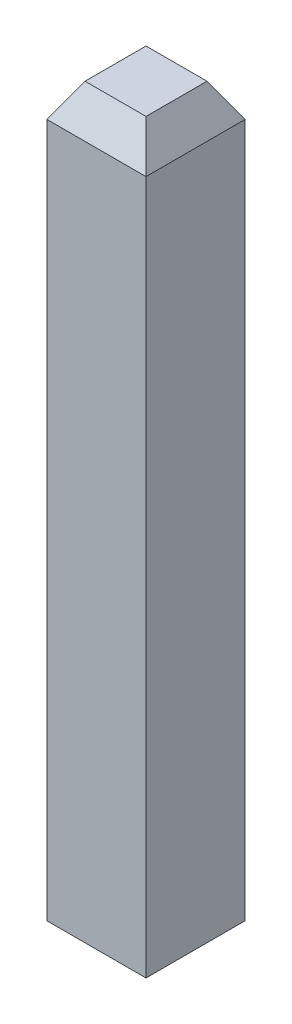
ISO-10303-21;
HEADER;
FILE_DESCRIPTION(('STEP AP214'),'2;1');
FILE_NAME('part.step','',(''),(''),'','','');
FILE_SCHEMA(('AUTOMOTIVE_DESIGN { 1 0 10303 214 1 1 1 1 }'));
ENDSEC;
DATA;
#1=APPLICATION_CONTEXT('core data for automotive mechanical design processes');
#2=APPLICATION_PROTOCOL_DEFINITION('international standard','automotive_design',2000,#1);
#3=PRODUCT_CONTEXT('',#1,'mechanical');
#4=PRODUCT('Part','Part','',(#3));
#5=PRODUCT_RELATED_PRODUCT_CATEGORY('part','',(#4));
#6=PRODUCT_DEFINITION_FORMATION('','',#4);
#7=PRODUCT_DEFINITION_CONTEXT('part definition',#1,'design');
#8=PRODUCT_DEFINITION('design','',#6,#7);
#9=PRODUCT_DEFINITION_SHAPE('','',#8);
#10=(LENGTH_UNIT() NAMED_UNIT(*) SI_UNIT(.MILLI.,.METRE.));
#11=(NAMED_UNIT(*) PLANE_ANGLE_UNIT() SI_UNIT($,.RADIAN.));
#12=(NAMED_UNIT(*) SI_UNIT($,.STERADIAN.) SOLID_ANGLE_UNIT());
#13=UNCERTAINTY_MEASURE_WITH_UNIT(LENGTH_MEASURE(1.E-05),#10,'distance_accuracy_value','');
#14=(GEOMETRIC_REPRESENTATION_CONTEXT(3) GLOBAL_UNCERTAINTY_ASSIGNED_CONTEXT((#13)) GLOBAL_UNIT_ASSIGNED_CONTEXT((#10,
#11,#12)) REPRESENTATION_CONTEXT('',''));
#15=CARTESIAN_POINT('',(0.,0.,0.));
#16=DIRECTION('',(0.,0.,1.));
#17=DIRECTION('',(1.,0.,0.));
#18=AXIS2_PLACEMENT_3D('',#15,#16,#17);
#19=CARTESIAN_POINT('',(-0.184529946162075,6.1,0.));
#20=DIRECTION('',(-0.86602540378444,0.499999999999998,0.));
#21=DIRECTION('',(-0.499999999999998,-0.86602540378444,0.));
#22=AXIS2_PLACEMENT_3D('',#19,#20,#21);
#23=PLANE('',#22);
#24=DIRECTION('',(-0.447213595499959,-0.774596669241484,0.447213595499956));
#25=VECTOR('',#24,1.);
#26=CARTESIAN_POINT('',(-0.184529946162075,6.1,0.734529946162076));
#27=LINE('',#26,#25);
#28=CARTESIAN_POINT('',(-0.184529946162075,6.1,0.734529946162076));
#29=VERTEX_POINT('',#28);
#30=CARTESIAN_POINT('',(-0.3,5.9,0.850000000000001));
#31=VERTEX_POINT('',#30);
#32=EDGE_CURVE('E80',#29,#31,#27,.T.);
#33=ORIENTED_EDGE('',*,*,#32,.F.);
#34=DIRECTION('',(0.,0.,1.));
#35=VECTOR('',#34,1.);
#36=CARTESIAN_POINT('',(-0.184529946162075,6.1,0.));
#37=LINE('',#36,#35);
#38=CARTESIAN_POINT('',(-0.184529946162075,6.1,0.365470053837926));
#39=VERTEX_POINT('',#38);
#40=EDGE_CURVE('E20',#39,#29,#37,.T.);
#41=ORIENTED_EDGE('',*,*,#40,.F.);
#42=DIRECTION('',(0.447213595499959,0.774596669241484,0.447213595499956));
#43=VECTOR('',#42,1.);
#44=CARTESIAN_POINT('',(-0.3,5.9,0.250000000000002));
#45=LINE('',#44,#43);
#46=CARTESIAN_POINT('',(-0.3,5.9,0.250000000000001));
#47=VERTEX_POINT('',#46);
#48=EDGE_CURVE('E66',#47,#39,#45,.T.);
#49=ORIENTED_EDGE('',*,*,#48,.F.);
#50=DIRECTION('',(0.,0.,-1.));
#51=VECTOR('',#50,1.);
#52=CARTESIAN_POINT('',(-0.3,5.9,0.250000000000001));
#53=LINE('',#52,#51);
#54=EDGE_CURVE('E87',#47,#31,#53,.F.);
#55=ORIENTED_EDGE('',*,*,#54,.T.);
#56=EDGE_LOOP('',(#33,#41,#49,#55));
#57=FACE_BOUND('',#56,.T.);
#58=ADVANCED_FACE('F17',(#57),#23,.T.);
#59=CARTESIAN_POINT('',(0.,6.1,0.));
#60=DIRECTION('',(0.,1.,0.));
#61=DIRECTION('',(0.,0.,1.));
#62=AXIS2_PLACEMENT_3D('',#59,#60,#61);
#63=PLANE('',#62);
#64=DIRECTION('',(0.,0.,1.));
#65=VECTOR('',#64,1.);
#66=CARTESIAN_POINT('',(0.184529946162075,6.1,0.));
#67=LINE('',#66,#65);
#68=CARTESIAN_POINT('',(0.184529946162075,6.1,0.365470053837926));
#69=VERTEX_POINT('',#68);
#70=CARTESIAN_POINT('',(0.184529946162075,6.1,0.734529946162076));
#71=VERTEX_POINT('',#70);
#72=EDGE_CURVE('E106',#69,#71,#67,.T.);
#73=ORIENTED_EDGE('',*,*,#72,.F.);
#74=DIRECTION('',(1.,0.,0.));
#75=VECTOR('',#74,1.);
#76=CARTESIAN_POINT('',(0.,6.1,0.365470053837926));
#77=LINE('',#76,#75);
#78=EDGE_CURVE('E77',#39,#69,#77,.T.);
#79=ORIENTED_EDGE('',*,*,#78,.F.);
#80=ORIENTED_EDGE('',*,*,#40,.T.);
#81=DIRECTION('',(1.,0.,0.));
#82=VECTOR('',#81,1.);
#83=CARTESIAN_POINT('',(0.,6.1,0.734529946162076));
#84=LINE('',#83,#82);
#85=EDGE_CURVE('E75',#71,#29,#84,.F.);
#86=ORIENTED_EDGE('',*,*,#85,.F.);
#87=EDGE_LOOP('',(#73,#79,#80,#86));
#88=FACE_BOUND('',#87,.T.);
#89=ADVANCED_FACE('F74',(#88),#63,.T.);
#90=CARTESIAN_POINT('',(0.,6.1,0.734529946162076));
#91=DIRECTION('',(0.,0.499999999999998,0.86602540378444));
#92=DIRECTION('',(0.,-0.86602540378444,0.499999999999998));
#93=AXIS2_PLACEMENT_3D('',#90,#91,#92);
#94=PLANE('',#93);
#95=DIRECTION('',(0.447213595499956,-0.774596669241484,0.447213595499959));
#96=VECTOR('',#95,1.);
#97=CARTESIAN_POINT('',(0.184529946162075,6.1,0.734529946162076));
#98=LINE('',#97,#96);
#99=CARTESIAN_POINT('',(0.3,5.9,0.850000000000001));
#100=VERTEX_POINT('',#99);
#101=EDGE_CURVE('E85',#71,#100,#98,.T.);
#102=ORIENTED_EDGE('',*,*,#101,.F.);
#103=ORIENTED_EDGE('',*,*,#85,.T.);
#104=ORIENTED_EDGE('',*,*,#32,.T.);
#105=DIRECTION('',(-1.,0.,0.));
#106=VECTOR('',#105,1.);
#107=CARTESIAN_POINT('',(-0.3,5.9,0.850000000000001));
#108=LINE('',#107,#106);
#109=EDGE_CURVE('E101',#31,#100,#108,.F.);
#110=ORIENTED_EDGE('',*,*,#109,.T.);
#111=EDGE_LOOP('',(#102,#103,#104,#110));
#112=FACE_BOUND('',#111,.T.);
#113=ADVANCED_FACE('F82',(#112),#94,.T.);
#114=CARTESIAN_POINT('',(0.,6.1,0.365470053837926));
#115=DIRECTION('',(0.,0.499999999999998,-0.86602540378444));
#116=DIRECTION('',(0.,0.86602540378444,0.499999999999998));
#117=AXIS2_PLACEMENT_3D('',#114,#115,#116);
#118=PLANE('',#117);
#119=ORIENTED_EDGE('',*,*,#48,.T.);
#120=ORIENTED_EDGE('',*,*,#78,.T.);
#121=DIRECTION('',(-0.447213595499956,0.774596669241484,0.447213595499959));
#122=VECTOR('',#121,1.);
#123=CARTESIAN_POINT('',(0.299999999999999,5.9,0.250000000000001));
#124=LINE('',#123,#122);
#125=CARTESIAN_POINT('',(0.3,5.9,0.250000000000001));
#126=VERTEX_POINT('',#125);
#127=EDGE_CURVE('E103',#126,#69,#124,.T.);
#128=ORIENTED_EDGE('',*,*,#127,.F.);
#129=DIRECTION('',(1.,0.,0.));
#130=VECTOR('',#129,1.);
#131=CARTESIAN_POINT('',(-0.3,5.9,0.250000000000001));
#132=LINE('',#131,#130);
#133=EDGE_CURVE('E34',#126,#47,#132,.F.);
#134=ORIENTED_EDGE('',*,*,#133,.T.);
#135=EDGE_LOOP('',(#119,#120,#128,#134));
#136=FACE_BOUND('',#135,.T.);
#137=ADVANCED_FACE('F154',(#136),#118,.T.);
#138=CARTESIAN_POINT('',(-0.3,6.1,0.250000000000001));
#139=DIRECTION('',(1.,0.,0.));
#140=DIRECTION('',(0.,0.,-1.));
#141=AXIS2_PLACEMENT_3D('',#138,#139,#140);
#142=PLANE('',#141);
#143=ORIENTED_EDGE('',*,*,#54,.F.);
#144=DIRECTION('',(0.,1.,0.));
#145=VECTOR('',#144,1.);
#146=CARTESIAN_POINT('',(-0.3,6.1,0.250000000000001));
#147=LINE('',#146,#145);
#148=CARTESIAN_POINT('',(-0.3,1.7,0.250000000000001));
#149=VERTEX_POINT('',#148);
#150=EDGE_CURVE('E113',#47,#149,#147,.F.);
#151=ORIENTED_EDGE('',*,*,#150,.T.);
#152=DIRECTION('',(0.,0.,1.));
#153=VECTOR('',#152,1.);
#154=CARTESIAN_POINT('',(-0.3,1.7,0.));
#155=LINE('',#154,#153);
#156=CARTESIAN_POINT('',(-0.3,1.7,0.850000000000001));
#157=VERTEX_POINT('',#156);
#158=EDGE_CURVE('E93',#149,#157,#155,.T.);
#159=ORIENTED_EDGE('',*,*,#158,.T.);
#160=DIRECTION('',(0.,1.,0.));
#161=VECTOR('',#160,1.);
#162=CARTESIAN_POINT('',(-0.3,6.1,0.850000000000001));
#163=LINE('',#162,#161);
#164=EDGE_CURVE('E98',#157,#31,#163,.T.);
#165=ORIENTED_EDGE('',*,*,#164,.T.);
#166=EDGE_LOOP('',(#143,#151,#159,#165));
#167=FACE_BOUND('',#166,.T.);
#168=ADVANCED_FACE('F151',(#167),#142,.F.);
#169=CARTESIAN_POINT('',(0.,1.7,0.));
#170=DIRECTION('',(0.,1.,0.));
#171=DIRECTION('',(0.,0.,1.));
#172=AXIS2_PLACEMENT_3D('',#169,#170,#171);
#173=PLANE('',#172);
#174=DIRECTION('',(-1.,0.,0.));
#175=VECTOR('',#174,1.);
#176=CARTESIAN_POINT('',(-0.3,1.7,0.850000000000001));
#177=LINE('',#176,#175);
#178=CARTESIAN_POINT('',(0.3,1.7,0.850000000000001));
#179=VERTEX_POINT('',#178);
#180=EDGE_CURVE('E95',#179,#157,#177,.T.);
#181=ORIENTED_EDGE('',*,*,#180,.T.);
#182=ORIENTED_EDGE('',*,*,#158,.F.);
#183=DIRECTION('',(1.,0.,0.));
#184=VECTOR('',#183,1.);
#185=CARTESIAN_POINT('',(-0.3,1.7,0.250000000000001));
#186=LINE('',#185,#184);
#187=CARTESIAN_POINT('',(0.3,1.7,0.250000000000001));
#188=VERTEX_POINT('',#187);
#189=EDGE_CURVE('E109',#149,#188,#186,.T.);
#190=ORIENTED_EDGE('',*,*,#189,.T.);
#191=DIRECTION('',(0.,0.,1.));
#192=VECTOR('',#191,1.);
#193=CARTESIAN_POINT('',(0.3,1.7,0.250000000000001));
#194=LINE('',#193,#192);
#195=EDGE_CURVE('E116',#188,#179,#194,.T.);
#196=ORIENTED_EDGE('',*,*,#195,.T.);
#197=EDGE_LOOP('',(#181,#182,#190,#196));
#198=FACE_BOUND('',#197,.T.);
#199=ADVANCED_FACE('F134',(#198),#173,.F.);
#200=CARTESIAN_POINT('',(-0.3,6.1,0.850000000000001));
#201=DIRECTION('',(0.,0.,-1.));
#202=DIRECTION('',(-1.,0.,0.));
#203=AXIS2_PLACEMENT_3D('',#200,#201,#202);
#204=PLANE('',#203);
#205=ORIENTED_EDGE('',*,*,#109,.F.);
#206=ORIENTED_EDGE('',*,*,#164,.F.);
#207=ORIENTED_EDGE('',*,*,#180,.F.);
#208=DIRECTION('',(0.,1.,0.));
#209=VECTOR('',#208,1.);
#210=CARTESIAN_POINT('',(0.3,6.1,0.850000000000001));
#211=LINE('',#210,#209);
#212=EDGE_CURVE('E119',#179,#100,#211,.T.);
#213=ORIENTED_EDGE('',*,*,#212,.T.);
#214=EDGE_LOOP('',(#205,#206,#207,#213));
#215=FACE_BOUND('',#214,.T.);
#216=ADVANCED_FACE('F131',(#215),#204,.F.);
#217=CARTESIAN_POINT('',(0.184529946162075,6.1,0.));
#218=DIRECTION('',(0.86602540378444,0.499999999999998,0.));
#219=DIRECTION('',(-0.499999999999998,0.86602540378444,0.));
#220=AXIS2_PLACEMENT_3D('',#217,#218,#219);
#221=PLANE('',#220);
#222=ORIENTED_EDGE('',*,*,#101,.T.);
#223=DIRECTION('',(0.,0.,1.));
#224=VECTOR('',#223,1.);
#225=CARTESIAN_POINT('',(0.3,5.9,0.250000000000001));
#226=LINE('',#225,#224);
#227=EDGE_CURVE('E26',#100,#126,#226,.F.);
#228=ORIENTED_EDGE('',*,*,#227,.T.);
#229=ORIENTED_EDGE('',*,*,#127,.T.);
#230=ORIENTED_EDGE('',*,*,#72,.T.);
#231=EDGE_LOOP('',(#222,#228,#229,#230));
#232=FACE_BOUND('',#231,.T.);
#233=ADVANCED_FACE('F125',(#232),#221,.T.);
#234=CARTESIAN_POINT('',(-0.3,6.1,0.250000000000001));
#235=DIRECTION('',(0.,0.,1.));
#236=DIRECTION('',(1.,0.,0.));
#237=AXIS2_PLACEMENT_3D('',#234,#235,#236);
#238=PLANE('',#237);
#239=ORIENTED_EDGE('',*,*,#133,.F.);
#240=DIRECTION('',(0.,1.,0.));
#241=VECTOR('',#240,1.);
#242=CARTESIAN_POINT('',(0.3,6.1,0.250000000000001));
#243=LINE('',#242,#241);
#244=EDGE_CURVE('E11',#126,#188,#243,.F.);
#245=ORIENTED_EDGE('',*,*,#244,.T.);
#246=ORIENTED_EDGE('',*,*,#189,.F.);
#247=ORIENTED_EDGE('',*,*,#150,.F.);
#248=EDGE_LOOP('',(#239,#245,#246,#247));
#249=FACE_BOUND('',#248,.T.);
#250=ADVANCED_FACE('F136',(#249),#238,.F.);
#251=CARTESIAN_POINT('',(0.3,6.1,0.250000000000001));
#252=DIRECTION('',(-1.,0.,0.));
#253=DIRECTION('',(0.,0.,1.));
#254=AXIS2_PLACEMENT_3D('',#251,#252,#253);
#255=PLANE('',#254);
#256=ORIENTED_EDGE('',*,*,#227,.F.);
#257=ORIENTED_EDGE('',*,*,#212,.F.);
#258=ORIENTED_EDGE('',*,*,#195,.F.);
#259=ORIENTED_EDGE('',*,*,#244,.F.);
#260=EDGE_LOOP('',(#256,#257,#258,#259));
#261=FACE_BOUND('',#260,.T.);
#262=ADVANCED_FACE('F129',(#261),#255,.F.);
#263=CLOSED_SHELL('',(#58,#89,#113,#137,#168,#199,#216,#233,#250,#262));
#264=MANIFOLD_SOLID_BREP('B1',#263);
#265=ADVANCED_BREP_SHAPE_REPRESENTATION('',(#18,#264),#14);
#266=SHAPE_DEFINITION_REPRESENTATION(#9,#265);
ENDSEC;
END-ISO-10303-21;
